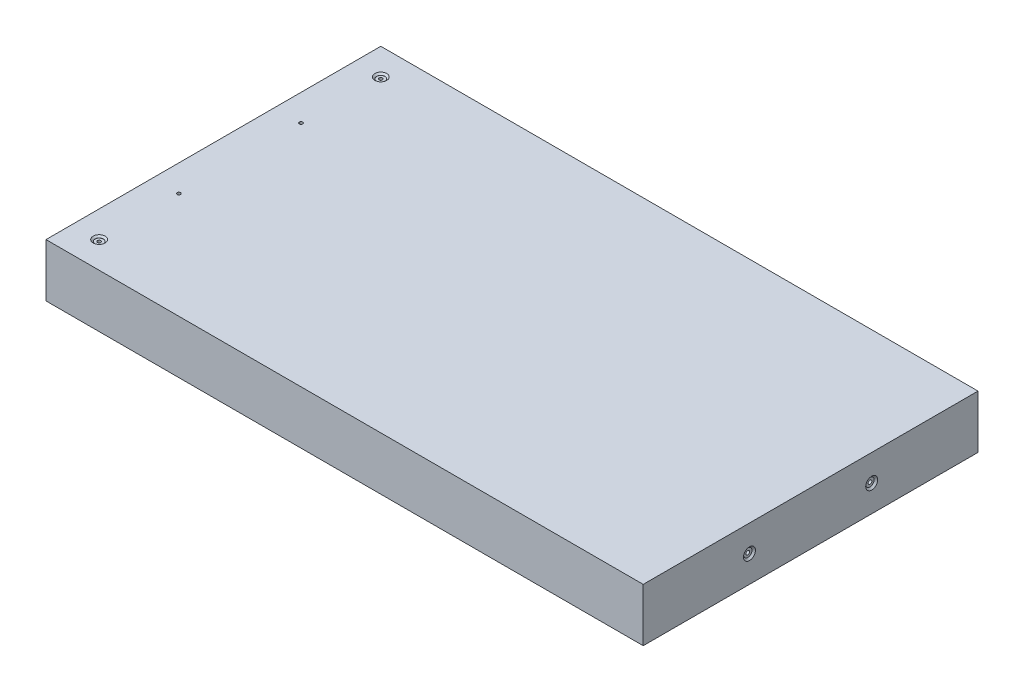
ISO-10303-21;
HEADER;
FILE_DESCRIPTION(('STEP AP214'),'2;1');
FILE_NAME('part.step','',(''),(''),'','','');
FILE_SCHEMA(('AUTOMOTIVE_DESIGN { 1 0 10303 214 1 1 1 1 }'));
ENDSEC;
DATA;
#1=APPLICATION_CONTEXT('core data for automotive mechanical design processes');
#2=APPLICATION_PROTOCOL_DEFINITION('international standard','automotive_design',2000,#1);
#3=PRODUCT_CONTEXT('',#1,'mechanical');
#4=PRODUCT('Part','Part','',(#3));
#5=PRODUCT_RELATED_PRODUCT_CATEGORY('part','',(#4));
#6=PRODUCT_DEFINITION_FORMATION('','',#4);
#7=PRODUCT_DEFINITION_CONTEXT('part definition',#1,'design');
#8=PRODUCT_DEFINITION('design','',#6,#7);
#9=PRODUCT_DEFINITION_SHAPE('','',#8);
#10=(LENGTH_UNIT() NAMED_UNIT(*) SI_UNIT(.MILLI.,.METRE.));
#11=(NAMED_UNIT(*) PLANE_ANGLE_UNIT() SI_UNIT($,.RADIAN.));
#12=(NAMED_UNIT(*) SI_UNIT($,.STERADIAN.) SOLID_ANGLE_UNIT());
#13=UNCERTAINTY_MEASURE_WITH_UNIT(LENGTH_MEASURE(1.E-05),#10,'distance_accuracy_value','');
#14=(GEOMETRIC_REPRESENTATION_CONTEXT(3) GLOBAL_UNCERTAINTY_ASSIGNED_CONTEXT((#13)) GLOBAL_UNIT_ASSIGNED_CONTEXT((#10,
#11,#12)) REPRESENTATION_CONTEXT('',''));
#15=CARTESIAN_POINT('',(0.,0.,0.));
#16=DIRECTION('',(0.,0.,1.));
#17=DIRECTION('',(1.,0.,0.));
#18=AXIS2_PLACEMENT_3D('',#15,#16,#17);
#19=CARTESIAN_POINT('',(142.7,25.4,-80.));
#20=DIRECTION('',(-1.,0.,0.));
#21=DIRECTION('',(0.,0.,1.));
#22=AXIS2_PLACEMENT_3D('',#19,#20,#21);
#23=PLANE('',#22);
#24=CARTESIAN_POINT('',(142.7,12.7,29.2));
#25=DIRECTION('',(1.,0.,0.));
#26=DIRECTION('',(0.,0.,-1.));
#27=AXIS2_PLACEMENT_3D('',#24,#25,#26);
#28=CIRCLE('',#27,2.8575);
#29=CARTESIAN_POINT('',(142.7,12.7,26.3425));
#30=VERTEX_POINT('',#29);
#31=EDGE_CURVE('E164',#30,#30,#28,.T.);
#32=ORIENTED_EDGE('',*,*,#31,.F.);
#33=EDGE_LOOP('',(#32));
#34=FACE_BOUND('',#33,.T.);
#35=CARTESIAN_POINT('',(142.7,12.7,-29.2));
#36=DIRECTION('',(1.,0.,0.));
#37=DIRECTION('',(0.,0.,-1.));
#38=AXIS2_PLACEMENT_3D('',#35,#36,#37);
#39=CIRCLE('',#38,2.8575);
#40=CARTESIAN_POINT('',(142.7,12.7,-32.0575));
#41=VERTEX_POINT('',#40);
#42=EDGE_CURVE('E97',#41,#41,#39,.T.);
#43=ORIENTED_EDGE('',*,*,#42,.F.);
#44=EDGE_LOOP('',(#43));
#45=FACE_BOUND('',#44,.T.);
#46=DIRECTION('',(0.,0.,-1.));
#47=VECTOR('',#46,1.);
#48=CARTESIAN_POINT('',(142.7,0.,-80.));
#49=LINE('',#48,#47);
#50=CARTESIAN_POINT('',(142.7,0.,80.));
#51=VERTEX_POINT('',#50);
#52=CARTESIAN_POINT('',(142.7,0.,-80.));
#53=VERTEX_POINT('',#52);
#54=EDGE_CURVE('E119',#51,#53,#49,.T.);
#55=ORIENTED_EDGE('',*,*,#54,.T.);
#56=DIRECTION('',(0.,-1.,0.));
#57=VECTOR('',#56,1.);
#58=CARTESIAN_POINT('',(142.7,25.4,-80.));
#59=LINE('',#58,#57);
#60=CARTESIAN_POINT('',(142.7,25.4,-80.));
#61=VERTEX_POINT('',#60);
#62=EDGE_CURVE('E11',#61,#53,#59,.T.);
#63=ORIENTED_EDGE('',*,*,#62,.F.);
#64=DIRECTION('',(0.,0.,-1.));
#65=VECTOR('',#64,1.);
#66=CARTESIAN_POINT('',(142.7,25.4,-80.));
#67=LINE('',#66,#65);
#68=CARTESIAN_POINT('',(142.7,25.4,80.));
#69=VERTEX_POINT('',#68);
#70=EDGE_CURVE('E120',#69,#61,#67,.T.);
#71=ORIENTED_EDGE('',*,*,#70,.F.);
#72=DIRECTION('',(0.,-1.,0.));
#73=VECTOR('',#72,1.);
#74=CARTESIAN_POINT('',(142.7,25.4,80.));
#75=LINE('',#74,#73);
#76=EDGE_CURVE('E126',#69,#51,#75,.T.);
#77=ORIENTED_EDGE('',*,*,#76,.T.);
#78=EDGE_LOOP('',(#55,#63,#71,#77));
#79=FACE_BOUND('',#78,.T.);
#80=ADVANCED_FACE('F33',(#34,#45,#79),#23,.F.);
#81=CARTESIAN_POINT('',(-142.7,25.4,-80.));
#82=DIRECTION('',(0.,0.,1.));
#83=DIRECTION('',(1.,0.,0.));
#84=AXIS2_PLACEMENT_3D('',#81,#82,#83);
#85=PLANE('',#84);
#86=DIRECTION('',(-1.,0.,0.));
#87=VECTOR('',#86,1.);
#88=CARTESIAN_POINT('',(-142.7,0.,-80.));
#89=LINE('',#88,#87);
#90=CARTESIAN_POINT('',(-142.7,0.,-80.));
#91=VERTEX_POINT('',#90);
#92=EDGE_CURVE('E129',#53,#91,#89,.T.);
#93=ORIENTED_EDGE('',*,*,#92,.T.);
#94=DIRECTION('',(0.,-1.,0.));
#95=VECTOR('',#94,1.);
#96=CARTESIAN_POINT('',(-142.7,25.4,-80.));
#97=LINE('',#96,#95);
#98=CARTESIAN_POINT('',(-142.7,25.4,-80.));
#99=VERTEX_POINT('',#98);
#100=EDGE_CURVE('E41',#99,#91,#97,.T.);
#101=ORIENTED_EDGE('',*,*,#100,.F.);
#102=DIRECTION('',(-1.,0.,0.));
#103=VECTOR('',#102,1.);
#104=CARTESIAN_POINT('',(-142.7,25.4,-80.));
#105=LINE('',#104,#103);
#106=EDGE_CURVE('E80',#61,#99,#105,.T.);
#107=ORIENTED_EDGE('',*,*,#106,.F.);
#108=ORIENTED_EDGE('',*,*,#62,.T.);
#109=EDGE_LOOP('',(#93,#101,#107,#108));
#110=FACE_BOUND('',#109,.T.);
#111=ADVANCED_FACE('F153',(#110),#85,.F.);
#112=CARTESIAN_POINT('',(-142.7,25.4,-80.));
#113=DIRECTION('',(1.,0.,0.));
#114=DIRECTION('',(0.,0.,-1.));
#115=AXIS2_PLACEMENT_3D('',#112,#113,#114);
#116=PLANE('',#115);
#117=DIRECTION('',(0.,0.,1.));
#118=VECTOR('',#117,1.);
#119=CARTESIAN_POINT('',(-142.7,0.,-80.));
#120=LINE('',#119,#118);
#121=CARTESIAN_POINT('',(-142.7,0.,80.));
#122=VERTEX_POINT('',#121);
#123=EDGE_CURVE('E67',#91,#122,#120,.T.);
#124=ORIENTED_EDGE('',*,*,#123,.T.);
#125=DIRECTION('',(0.,-1.,0.));
#126=VECTOR('',#125,1.);
#127=CARTESIAN_POINT('',(-142.7,25.4,80.));
#128=LINE('',#127,#126);
#129=CARTESIAN_POINT('',(-142.7,25.4,80.));
#130=VERTEX_POINT('',#129);
#131=EDGE_CURVE('E134',#130,#122,#128,.T.);
#132=ORIENTED_EDGE('',*,*,#131,.F.);
#133=DIRECTION('',(0.,0.,1.));
#134=VECTOR('',#133,1.);
#135=CARTESIAN_POINT('',(-142.7,25.4,-80.));
#136=LINE('',#135,#134);
#137=EDGE_CURVE('E123',#99,#130,#136,.T.);
#138=ORIENTED_EDGE('',*,*,#137,.F.);
#139=ORIENTED_EDGE('',*,*,#100,.T.);
#140=EDGE_LOOP('',(#124,#132,#138,#139));
#141=FACE_BOUND('',#140,.T.);
#142=ADVANCED_FACE('F136',(#141),#116,.F.);
#143=CARTESIAN_POINT('',(-142.7,25.4,80.));
#144=DIRECTION('',(0.,0.,-1.));
#145=DIRECTION('',(-1.,0.,0.));
#146=AXIS2_PLACEMENT_3D('',#143,#144,#145);
#147=PLANE('',#146);
#148=DIRECTION('',(1.,0.,0.));
#149=VECTOR('',#148,1.);
#150=CARTESIAN_POINT('',(-142.7,0.,80.));
#151=LINE('',#150,#149);
#152=EDGE_CURVE('E73',#122,#51,#151,.T.);
#153=ORIENTED_EDGE('',*,*,#152,.T.);
#154=ORIENTED_EDGE('',*,*,#76,.F.);
#155=DIRECTION('',(1.,0.,0.));
#156=VECTOR('',#155,1.);
#157=CARTESIAN_POINT('',(-142.7,25.4,80.));
#158=LINE('',#157,#156);
#159=EDGE_CURVE('E49',#130,#69,#158,.T.);
#160=ORIENTED_EDGE('',*,*,#159,.F.);
#161=ORIENTED_EDGE('',*,*,#131,.T.);
#162=EDGE_LOOP('',(#153,#154,#160,#161));
#163=FACE_BOUND('',#162,.T.);
#164=ADVANCED_FACE('F143',(#163),#147,.F.);
#165=CARTESIAN_POINT('',(0.,25.4,0.));
#166=DIRECTION('',(0.,1.,0.));
#167=DIRECTION('',(0.,0.,1.));
#168=AXIS2_PLACEMENT_3D('',#165,#166,#167);
#169=PLANE('',#168);
#170=CARTESIAN_POINT('',(-130.,25.4,-29.2));
#171=DIRECTION('',(0.,-1.,0.));
#172=DIRECTION('',(0.,0.,-1.));
#173=AXIS2_PLACEMENT_3D('',#170,#171,#172);
#174=CIRCLE('',#173,0.806449999999986);
#175=CARTESIAN_POINT('',(-130.,25.4,-30.00645));
#176=VERTEX_POINT('',#175);
#177=EDGE_CURVE('E447',#176,#176,#174,.T.);
#178=ORIENTED_EDGE('',*,*,#177,.T.);
#179=EDGE_LOOP('',(#178));
#180=FACE_BOUND('',#179,.T.);
#181=CARTESIAN_POINT('',(-130.,25.4,29.2));
#182=DIRECTION('',(0.,-1.,0.));
#183=DIRECTION('',(0.,0.,-1.));
#184=AXIS2_PLACEMENT_3D('',#181,#182,#183);
#185=CIRCLE('',#184,0.806449999999986);
#186=CARTESIAN_POINT('',(-130.,25.4,28.39355));
#187=VERTEX_POINT('',#186);
#188=EDGE_CURVE('E460',#187,#187,#185,.T.);
#189=ORIENTED_EDGE('',*,*,#188,.T.);
#190=EDGE_LOOP('',(#189));
#191=FACE_BOUND('',#190,.T.);
#192=CARTESIAN_POINT('',(-130.,25.4,67.3));
#193=DIRECTION('',(0.,1.,0.));
#194=DIRECTION('',(0.,0.,1.));
#195=AXIS2_PLACEMENT_3D('',#192,#193,#194);
#196=CIRCLE('',#195,2.85750000000001);
#197=CARTESIAN_POINT('',(-130.,25.4,70.1575));
#198=VERTEX_POINT('',#197);
#199=EDGE_CURVE('E463',#198,#198,#196,.T.);
#200=ORIENTED_EDGE('',*,*,#199,.F.);
#201=EDGE_LOOP('',(#200));
#202=FACE_BOUND('',#201,.T.);
#203=CARTESIAN_POINT('',(-130.,25.4,-67.3));
#204=DIRECTION('',(0.,1.,0.));
#205=DIRECTION('',(0.,0.,1.));
#206=AXIS2_PLACEMENT_3D('',#203,#204,#205);
#207=CIRCLE('',#206,2.85750000000001);
#208=CARTESIAN_POINT('',(-130.,25.4,-64.4425));
#209=VERTEX_POINT('',#208);
#210=EDGE_CURVE('E476',#209,#209,#207,.T.);
#211=ORIENTED_EDGE('',*,*,#210,.F.);
#212=EDGE_LOOP('',(#211));
#213=FACE_BOUND('',#212,.T.);
#214=ORIENTED_EDGE('',*,*,#70,.T.);
#215=ORIENTED_EDGE('',*,*,#106,.T.);
#216=ORIENTED_EDGE('',*,*,#137,.T.);
#217=ORIENTED_EDGE('',*,*,#159,.T.);
#218=EDGE_LOOP('',(#214,#215,#216,#217));
#219=FACE_BOUND('',#218,.T.);
#220=ADVANCED_FACE('F145',(#180,#191,#202,#213,#219),#169,.T.);
#221=CARTESIAN_POINT('',(0.,0.,0.));
#222=DIRECTION('',(0.,1.,0.));
#223=DIRECTION('',(0.,0.,1.));
#224=AXIS2_PLACEMENT_3D('',#221,#222,#223);
#225=PLANE('',#224);
#226=CARTESIAN_POINT('',(-130.,0.,-29.2));
#227=DIRECTION('',(0.,-1.,0.));
#228=DIRECTION('',(0.,0.,-1.));
#229=AXIS2_PLACEMENT_3D('',#226,#227,#228);
#230=CIRCLE('',#229,2.85750000000001);
#231=CARTESIAN_POINT('',(-130.,0.,-32.0575));
#232=VERTEX_POINT('',#231);
#233=EDGE_CURVE('E197',#232,#232,#230,.T.);
#234=ORIENTED_EDGE('',*,*,#233,.F.);
#235=EDGE_LOOP('',(#234));
#236=FACE_BOUND('',#235,.T.);
#237=CARTESIAN_POINT('',(-130.,0.,29.2));
#238=DIRECTION('',(0.,-1.,0.));
#239=DIRECTION('',(0.,0.,-1.));
#240=AXIS2_PLACEMENT_3D('',#237,#238,#239);
#241=CIRCLE('',#240,2.85750000000001);
#242=CARTESIAN_POINT('',(-130.,0.,26.3425));
#243=VERTEX_POINT('',#242);
#244=EDGE_CURVE('E201',#243,#243,#241,.T.);
#245=ORIENTED_EDGE('',*,*,#244,.F.);
#246=EDGE_LOOP('',(#245));
#247=FACE_BOUND('',#246,.T.);
#248=CARTESIAN_POINT('',(-130.,0.,67.3));
#249=DIRECTION('',(0.,1.,0.));
#250=DIRECTION('',(0.,0.,1.));
#251=AXIS2_PLACEMENT_3D('',#248,#249,#250);
#252=CIRCLE('',#251,0.806449999999986);
#253=CARTESIAN_POINT('',(-130.,0.,68.10645));
#254=VERTEX_POINT('',#253);
#255=EDGE_CURVE('E205',#254,#254,#252,.T.);
#256=ORIENTED_EDGE('',*,*,#255,.T.);
#257=EDGE_LOOP('',(#256));
#258=FACE_BOUND('',#257,.T.);
#259=CARTESIAN_POINT('',(-130.,0.,-67.3));
#260=DIRECTION('',(0.,1.,0.));
#261=DIRECTION('',(0.,0.,1.));
#262=AXIS2_PLACEMENT_3D('',#259,#260,#261);
#263=CIRCLE('',#262,0.806449999999986);
#264=CARTESIAN_POINT('',(-130.,0.,-66.49355));
#265=VERTEX_POINT('',#264);
#266=EDGE_CURVE('E208',#265,#265,#263,.T.);
#267=ORIENTED_EDGE('',*,*,#266,.T.);
#268=EDGE_LOOP('',(#267));
#269=FACE_BOUND('',#268,.T.);
#270=ORIENTED_EDGE('',*,*,#54,.F.);
#271=ORIENTED_EDGE('',*,*,#152,.F.);
#272=ORIENTED_EDGE('',*,*,#123,.F.);
#273=ORIENTED_EDGE('',*,*,#92,.F.);
#274=EDGE_LOOP('',(#270,#271,#272,#273));
#275=FACE_BOUND('',#274,.T.);
#276=ADVANCED_FACE('F139',(#236,#247,#258,#269,#275),#225,.F.);
#277=CARTESIAN_POINT('',(112.7,12.7,-29.2));
#278=DIRECTION('',(1.,0.,0.));
#279=DIRECTION('',(0.,0.,-1.));
#280=AXIS2_PLACEMENT_3D('',#277,#278,#279);
#281=CONICAL_SURFACE('',#280,0.889000000000001,1.02974425867665);
#282=CARTESIAN_POINT('',(112.165834909685,12.7,-29.2));
#283=VERTEX_POINT('',#282);
#284=VERTEX_LOOP('',#283);
#285=FACE_BOUND('',#284,.T.);
#286=CARTESIAN_POINT('',(112.7,12.7,-29.2));
#287=DIRECTION('',(1.,0.,0.));
#288=DIRECTION('',(0.,0.,-1.));
#289=AXIS2_PLACEMENT_3D('',#286,#287,#288);
#290=CIRCLE('',#289,0.889000000000001);
#291=CARTESIAN_POINT('',(112.7,12.7,-30.089));
#292=VERTEX_POINT('',#291);
#293=EDGE_CURVE('E116',#292,#292,#290,.T.);
#294=ORIENTED_EDGE('',*,*,#293,.T.);
#295=EDGE_LOOP('',(#294));
#296=FACE_BOUND('',#295,.T.);
#297=ADVANCED_FACE('F186',(#285,#296),#281,.F.);
#298=CARTESIAN_POINT('',(142.7,12.7,-29.2));
#299=DIRECTION('',(1.,0.,0.));
#300=DIRECTION('',(0.,0.,-1.));
#301=AXIS2_PLACEMENT_3D('',#298,#299,#300);
#302=CYLINDRICAL_SURFACE('',#301,0.889000000000003);
#303=ORIENTED_EDGE('',*,*,#293,.F.);
#304=EDGE_LOOP('',(#303));
#305=FACE_BOUND('',#304,.T.);
#306=CARTESIAN_POINT('',(141.8872,12.7,-29.2));
#307=DIRECTION('',(1.,0.,0.));
#308=DIRECTION('',(0.,0.,-1.));
#309=AXIS2_PLACEMENT_3D('',#306,#307,#308);
#310=CIRCLE('',#309,0.889000000000004);
#311=CARTESIAN_POINT('',(141.8872,12.7,-30.089));
#312=VERTEX_POINT('',#311);
#313=EDGE_CURVE('E113',#312,#312,#310,.T.);
#314=ORIENTED_EDGE('',*,*,#313,.T.);
#315=EDGE_LOOP('',(#314));
#316=FACE_BOUND('',#315,.T.);
#317=ADVANCED_FACE('F182',(#305,#316),#302,.F.);
#318=CARTESIAN_POINT('',(141.8872,13.589,-29.2));
#319=DIRECTION('',(-1.,0.,0.));
#320=DIRECTION('',(0.,0.,1.));
#321=AXIS2_PLACEMENT_3D('',#318,#319,#320);
#322=PLANE('',#321);
#323=ORIENTED_EDGE('',*,*,#313,.F.);
#324=EDGE_LOOP('',(#323));
#325=FACE_BOUND('',#324,.T.);
#326=CARTESIAN_POINT('',(141.8872,12.7,-29.2));
#327=DIRECTION('',(1.,0.,0.));
#328=DIRECTION('',(0.,0.,-1.));
#329=AXIS2_PLACEMENT_3D('',#326,#327,#328);
#330=CIRCLE('',#329,1.98501);
#331=CARTESIAN_POINT('',(141.8872,12.7,-31.18501));
#332=VERTEX_POINT('',#331);
#333=EDGE_CURVE('E110',#332,#332,#330,.T.);
#334=ORIENTED_EDGE('',*,*,#333,.T.);
#335=EDGE_LOOP('',(#334));
#336=FACE_BOUND('',#335,.T.);
#337=ADVANCED_FACE('F174',(#325,#336),#322,.F.);
#338=CARTESIAN_POINT('',(142.7,12.7,-29.2));
#339=DIRECTION('',(1.,0.,0.));
#340=DIRECTION('',(0.,0.,-1.));
#341=AXIS2_PLACEMENT_3D('',#338,#339,#340);
#342=CYLINDRICAL_SURFACE('',#341,1.98501);
#343=ORIENTED_EDGE('',*,*,#333,.F.);
#344=EDGE_LOOP('',(#343));
#345=FACE_BOUND('',#344,.T.);
#346=CARTESIAN_POINT('',(141.82751,12.7,-29.2));
#347=DIRECTION('',(1.,0.,0.));
#348=DIRECTION('',(0.,0.,-1.));
#349=AXIS2_PLACEMENT_3D('',#346,#347,#348);
#350=CIRCLE('',#349,1.98501);
#351=CARTESIAN_POINT('',(141.82751,12.7,-31.18501));
#352=VERTEX_POINT('',#351);
#353=EDGE_CURVE('E101',#352,#352,#350,.T.);
#354=ORIENTED_EDGE('',*,*,#353,.T.);
#355=EDGE_LOOP('',(#354));
#356=FACE_BOUND('',#355,.T.);
#357=ADVANCED_FACE('F168',(#345,#356),#342,.T.);
#358=CARTESIAN_POINT('',(142.7,12.7,-29.2));
#359=DIRECTION('',(1.,0.,0.));
#360=DIRECTION('',(0.,0.,-1.));
#361=AXIS2_PLACEMENT_3D('',#358,#359,#360);
#362=CONICAL_SURFACE('',#361,2.8575,0.785398163397446);
#363=ORIENTED_EDGE('',*,*,#353,.F.);
#364=EDGE_LOOP('',(#363));
#365=FACE_BOUND('',#364,.T.);
#366=ORIENTED_EDGE('',*,*,#42,.T.);
#367=EDGE_LOOP('',(#366));
#368=FACE_BOUND('',#367,.T.);
#369=ADVANCED_FACE('F91',(#365,#368),#362,.F.);
#370=CARTESIAN_POINT('',(112.7,12.7,29.2));
#371=DIRECTION('',(1.,0.,0.));
#372=DIRECTION('',(0.,0.,-1.));
#373=AXIS2_PLACEMENT_3D('',#370,#371,#372);
#374=CONICAL_SURFACE('',#373,0.889000000000001,1.02974425867665);
#375=CARTESIAN_POINT('',(112.165834909685,12.7,29.2));
#376=VERTEX_POINT('',#375);
#377=VERTEX_LOOP('',#376);
#378=FACE_BOUND('',#377,.T.);
#379=CARTESIAN_POINT('',(112.7,12.7,29.2));
#380=DIRECTION('',(1.,0.,0.));
#381=DIRECTION('',(0.,0.,-1.));
#382=AXIS2_PLACEMENT_3D('',#379,#380,#381);
#383=CIRCLE('',#382,0.889000000000001);
#384=CARTESIAN_POINT('',(112.7,12.7,28.311));
#385=VERTEX_POINT('',#384);
#386=EDGE_CURVE('E95',#385,#385,#383,.T.);
#387=ORIENTED_EDGE('',*,*,#386,.T.);
#388=EDGE_LOOP('',(#387));
#389=FACE_BOUND('',#388,.T.);
#390=ADVANCED_FACE('F87',(#378,#389),#374,.F.);
#391=CARTESIAN_POINT('',(142.7,12.7,29.2));
#392=DIRECTION('',(1.,0.,0.));
#393=DIRECTION('',(0.,0.,-1.));
#394=AXIS2_PLACEMENT_3D('',#391,#392,#393);
#395=CYLINDRICAL_SURFACE('',#394,0.889000000000003);
#396=ORIENTED_EDGE('',*,*,#386,.F.);
#397=EDGE_LOOP('',(#396));
#398=FACE_BOUND('',#397,.T.);
#399=CARTESIAN_POINT('',(141.8872,12.7,29.2));
#400=DIRECTION('',(1.,0.,0.));
#401=DIRECTION('',(0.,0.,-1.));
#402=AXIS2_PLACEMENT_3D('',#399,#400,#401);
#403=CIRCLE('',#402,0.889000000000004);
#404=CARTESIAN_POINT('',(141.8872,12.7,28.311));
#405=VERTEX_POINT('',#404);
#406=EDGE_CURVE('E98',#405,#405,#403,.T.);
#407=ORIENTED_EDGE('',*,*,#406,.T.);
#408=EDGE_LOOP('',(#407));
#409=FACE_BOUND('',#408,.T.);
#410=ADVANCED_FACE('F90',(#398,#409),#395,.F.);
#411=CARTESIAN_POINT('',(141.8872,13.589,29.2));
#412=DIRECTION('',(-1.,0.,0.));
#413=DIRECTION('',(0.,0.,1.));
#414=AXIS2_PLACEMENT_3D('',#411,#412,#413);
#415=PLANE('',#414);
#416=ORIENTED_EDGE('',*,*,#406,.F.);
#417=EDGE_LOOP('',(#416));
#418=FACE_BOUND('',#417,.T.);
#419=CARTESIAN_POINT('',(141.8872,12.7,29.2));
#420=DIRECTION('',(1.,0.,0.));
#421=DIRECTION('',(0.,0.,-1.));
#422=AXIS2_PLACEMENT_3D('',#419,#420,#421);
#423=CIRCLE('',#422,1.98501);
#424=CARTESIAN_POINT('',(141.8872,12.7,27.21499));
#425=VERTEX_POINT('',#424);
#426=EDGE_CURVE('E104',#425,#425,#423,.T.);
#427=ORIENTED_EDGE('',*,*,#426,.T.);
#428=EDGE_LOOP('',(#427));
#429=FACE_BOUND('',#428,.T.);
#430=ADVANCED_FACE('F223',(#418,#429),#415,.F.);
#431=CARTESIAN_POINT('',(142.7,12.7,29.2));
#432=DIRECTION('',(1.,0.,0.));
#433=DIRECTION('',(0.,0.,-1.));
#434=AXIS2_PLACEMENT_3D('',#431,#432,#433);
#435=CYLINDRICAL_SURFACE('',#434,1.98501);
#436=ORIENTED_EDGE('',*,*,#426,.F.);
#437=EDGE_LOOP('',(#436));
#438=FACE_BOUND('',#437,.T.);
#439=CARTESIAN_POINT('',(141.82751,12.7,29.2));
#440=DIRECTION('',(1.,0.,0.));
#441=DIRECTION('',(0.,0.,-1.));
#442=AXIS2_PLACEMENT_3D('',#439,#440,#441);
#443=CIRCLE('',#442,1.98501);
#444=CARTESIAN_POINT('',(141.82751,12.7,27.21499));
#445=VERTEX_POINT('',#444);
#446=EDGE_CURVE('E212',#445,#445,#443,.T.);
#447=ORIENTED_EDGE('',*,*,#446,.T.);
#448=EDGE_LOOP('',(#447));
#449=FACE_BOUND('',#448,.T.);
#450=ADVANCED_FACE('F225',(#438,#449),#435,.T.);
#451=CARTESIAN_POINT('',(142.7,12.7,29.2));
#452=DIRECTION('',(1.,0.,0.));
#453=DIRECTION('',(0.,0.,-1.));
#454=AXIS2_PLACEMENT_3D('',#451,#452,#453);
#455=CONICAL_SURFACE('',#454,2.8575,0.785398163397446);
#456=ORIENTED_EDGE('',*,*,#446,.F.);
#457=EDGE_LOOP('',(#456));
#458=FACE_BOUND('',#457,.T.);
#459=ORIENTED_EDGE('',*,*,#31,.T.);
#460=EDGE_LOOP('',(#459));
#461=FACE_BOUND('',#460,.T.);
#462=ADVANCED_FACE('F228',(#458,#461),#455,.F.);
#463=CARTESIAN_POINT('',(-130.,25.4,-67.3));
#464=DIRECTION('',(0.,1.,0.));
#465=DIRECTION('',(0.,0.,1.));
#466=AXIS2_PLACEMENT_3D('',#463,#464,#465);
#467=CYLINDRICAL_SURFACE('',#466,0.80645);
#468=ORIENTED_EDGE('',*,*,#266,.F.);
#469=EDGE_LOOP('',(#468));
#470=FACE_BOUND('',#469,.T.);
#471=CARTESIAN_POINT('',(-130.,24.5872,-67.3));
#472=DIRECTION('',(0.,1.,0.));
#473=DIRECTION('',(0.,0.,1.));
#474=AXIS2_PLACEMENT_3D('',#471,#472,#473);
#475=CIRCLE('',#474,0.806450000000014);
#476=CARTESIAN_POINT('',(-130.,24.5872,-66.49355));
#477=VERTEX_POINT('',#476);
#478=EDGE_CURVE('E210',#477,#477,#475,.T.);
#479=ORIENTED_EDGE('',*,*,#478,.T.);
#480=EDGE_LOOP('',(#479));
#481=FACE_BOUND('',#480,.T.);
#482=ADVANCED_FACE('F234',(#470,#481),#467,.F.);
#483=CARTESIAN_POINT('',(-128.01499,24.5872,-67.3));
#484=DIRECTION('',(0.,-1.,0.));
#485=DIRECTION('',(0.,0.,-1.));
#486=AXIS2_PLACEMENT_3D('',#483,#484,#485);
#487=PLANE('',#486);
#488=ORIENTED_EDGE('',*,*,#478,.F.);
#489=EDGE_LOOP('',(#488));
#490=FACE_BOUND('',#489,.T.);
#491=CARTESIAN_POINT('',(-130.,24.5872,-67.3));
#492=DIRECTION('',(0.,1.,0.));
#493=DIRECTION('',(0.,0.,1.));
#494=AXIS2_PLACEMENT_3D('',#491,#492,#493);
#495=CIRCLE('',#494,1.98501000000001);
#496=CARTESIAN_POINT('',(-130.,24.5872,-65.31499));
#497=VERTEX_POINT('',#496);
#498=EDGE_CURVE('E215',#497,#497,#495,.T.);
#499=ORIENTED_EDGE('',*,*,#498,.T.);
#500=EDGE_LOOP('',(#499));
#501=FACE_BOUND('',#500,.T.);
#502=ADVANCED_FACE('F239',(#490,#501),#487,.F.);
#503=CARTESIAN_POINT('',(-130.,25.4,-67.3));
#504=DIRECTION('',(0.,1.,0.));
#505=DIRECTION('',(0.,0.,1.));
#506=AXIS2_PLACEMENT_3D('',#503,#504,#505);
#507=CYLINDRICAL_SURFACE('',#506,1.98501000000001);
#508=ORIENTED_EDGE('',*,*,#498,.F.);
#509=EDGE_LOOP('',(#508));
#510=FACE_BOUND('',#509,.T.);
#511=CARTESIAN_POINT('',(-130.,24.6678939627941,-67.3));
#512=DIRECTION('',(0.,1.,0.));
#513=DIRECTION('',(0.,0.,1.));
#514=AXIS2_PLACEMENT_3D('',#511,#512,#513);
#515=CIRCLE('',#514,1.98501000000001);
#516=CARTESIAN_POINT('',(-130.,24.6678939627941,-65.31499));
#517=VERTEX_POINT('',#516);
#518=EDGE_CURVE('E479',#517,#517,#515,.T.);
#519=ORIENTED_EDGE('',*,*,#518,.T.);
#520=EDGE_LOOP('',(#519));
#521=FACE_BOUND('',#520,.T.);
#522=ADVANCED_FACE('F279',(#510,#521),#507,.F.);
#523=CARTESIAN_POINT('',(-130.,25.4,-67.3));
#524=DIRECTION('',(0.,1.,0.));
#525=DIRECTION('',(0.,0.,1.));
#526=AXIS2_PLACEMENT_3D('',#523,#524,#525);
#527=CONICAL_SURFACE('',#526,2.85750000000001,0.872664625997166);
#528=ORIENTED_EDGE('',*,*,#518,.F.);
#529=EDGE_LOOP('',(#528));
#530=FACE_BOUND('',#529,.T.);
#531=ORIENTED_EDGE('',*,*,#210,.T.);
#532=EDGE_LOOP('',(#531));
#533=FACE_BOUND('',#532,.T.);
#534=ADVANCED_FACE('F288',(#530,#533),#527,.F.);
#535=CARTESIAN_POINT('',(-130.,25.4,67.3));
#536=DIRECTION('',(0.,1.,0.));
#537=DIRECTION('',(0.,0.,1.));
#538=AXIS2_PLACEMENT_3D('',#535,#536,#537);
#539=CYLINDRICAL_SURFACE('',#538,0.80645);
#540=ORIENTED_EDGE('',*,*,#255,.F.);
#541=EDGE_LOOP('',(#540));
#542=FACE_BOUND('',#541,.T.);
#543=CARTESIAN_POINT('',(-130.,24.5872,67.3));
#544=DIRECTION('',(0.,1.,0.));
#545=DIRECTION('',(0.,0.,1.));
#546=AXIS2_PLACEMENT_3D('',#543,#544,#545);
#547=CIRCLE('',#546,0.806450000000014);
#548=CARTESIAN_POINT('',(-130.,24.5872,68.10645));
#549=VERTEX_POINT('',#548);
#550=EDGE_CURVE('E472',#549,#549,#547,.T.);
#551=ORIENTED_EDGE('',*,*,#550,.T.);
#552=EDGE_LOOP('',(#551));
#553=FACE_BOUND('',#552,.T.);
#554=ADVANCED_FACE('F298',(#542,#553),#539,.F.);
#555=CARTESIAN_POINT('',(-128.01499,24.5872,67.3));
#556=DIRECTION('',(0.,-1.,0.));
#557=DIRECTION('',(0.,0.,-1.));
#558=AXIS2_PLACEMENT_3D('',#555,#556,#557);
#559=PLANE('',#558);
#560=ORIENTED_EDGE('',*,*,#550,.F.);
#561=EDGE_LOOP('',(#560));
#562=FACE_BOUND('',#561,.T.);
#563=CARTESIAN_POINT('',(-130.,24.5872,67.3));
#564=DIRECTION('',(0.,1.,0.));
#565=DIRECTION('',(0.,0.,1.));
#566=AXIS2_PLACEMENT_3D('',#563,#564,#565);
#567=CIRCLE('',#566,1.98501000000001);
#568=CARTESIAN_POINT('',(-130.,24.5872,69.28501));
#569=VERTEX_POINT('',#568);
#570=EDGE_CURVE('E469',#569,#569,#567,.T.);
#571=ORIENTED_EDGE('',*,*,#570,.T.);
#572=EDGE_LOOP('',(#571));
#573=FACE_BOUND('',#572,.T.);
#574=ADVANCED_FACE('F308',(#562,#573),#559,.F.);
#575=CARTESIAN_POINT('',(-130.,25.4,67.3));
#576=DIRECTION('',(0.,1.,0.));
#577=DIRECTION('',(0.,0.,1.));
#578=AXIS2_PLACEMENT_3D('',#575,#576,#577);
#579=CYLINDRICAL_SURFACE('',#578,1.98501000000001);
#580=ORIENTED_EDGE('',*,*,#570,.F.);
#581=EDGE_LOOP('',(#580));
#582=FACE_BOUND('',#581,.T.);
#583=CARTESIAN_POINT('',(-130.,24.6678939627941,67.3));
#584=DIRECTION('',(0.,1.,0.));
#585=DIRECTION('',(0.,0.,1.));
#586=AXIS2_PLACEMENT_3D('',#583,#584,#585);
#587=CIRCLE('',#586,1.98501000000001);
#588=CARTESIAN_POINT('',(-130.,24.6678939627941,69.28501));
#589=VERTEX_POINT('',#588);
#590=EDGE_CURVE('E466',#589,#589,#587,.T.);
#591=ORIENTED_EDGE('',*,*,#590,.T.);
#592=EDGE_LOOP('',(#591));
#593=FACE_BOUND('',#592,.T.);
#594=ADVANCED_FACE('F318',(#582,#593),#579,.F.);
#595=CARTESIAN_POINT('',(-130.,25.4,67.3));
#596=DIRECTION('',(0.,1.,0.));
#597=DIRECTION('',(0.,0.,1.));
#598=AXIS2_PLACEMENT_3D('',#595,#596,#597);
#599=CONICAL_SURFACE('',#598,2.85750000000001,0.872664625997166);
#600=ORIENTED_EDGE('',*,*,#590,.F.);
#601=EDGE_LOOP('',(#600));
#602=FACE_BOUND('',#601,.T.);
#603=ORIENTED_EDGE('',*,*,#199,.T.);
#604=EDGE_LOOP('',(#603));
#605=FACE_BOUND('',#604,.T.);
#606=ADVANCED_FACE('F328',(#602,#605),#599,.F.);
#607=CARTESIAN_POINT('',(-130.,0.,29.2));
#608=DIRECTION('',(0.,-1.,0.));
#609=DIRECTION('',(0.,0.,-1.));
#610=AXIS2_PLACEMENT_3D('',#607,#608,#609);
#611=CYLINDRICAL_SURFACE('',#610,0.80645);
#612=ORIENTED_EDGE('',*,*,#188,.F.);
#613=EDGE_LOOP('',(#612));
#614=FACE_BOUND('',#613,.T.);
#615=CARTESIAN_POINT('',(-130.,0.812799999999992,29.2));
#616=DIRECTION('',(0.,-1.,0.));
#617=DIRECTION('',(0.,0.,-1.));
#618=AXIS2_PLACEMENT_3D('',#615,#616,#617);
#619=CIRCLE('',#618,0.806450000000014);
#620=CARTESIAN_POINT('',(-130.,0.812799999999992,28.39355));
#621=VERTEX_POINT('',#620);
#622=EDGE_CURVE('E457',#621,#621,#619,.T.);
#623=ORIENTED_EDGE('',*,*,#622,.T.);
#624=EDGE_LOOP('',(#623));
#625=FACE_BOUND('',#624,.T.);
#626=ADVANCED_FACE('F338',(#614,#625),#611,.F.);
#627=CARTESIAN_POINT('',(-128.01499,0.812799999999992,29.2));
#628=DIRECTION('',(0.,1.,0.));
#629=DIRECTION('',(0.,0.,1.));
#630=AXIS2_PLACEMENT_3D('',#627,#628,#629);
#631=PLANE('',#630);
#632=ORIENTED_EDGE('',*,*,#622,.F.);
#633=EDGE_LOOP('',(#632));
#634=FACE_BOUND('',#633,.T.);
#635=CARTESIAN_POINT('',(-130.,0.812799999999992,29.2));
#636=DIRECTION('',(0.,-1.,0.));
#637=DIRECTION('',(0.,0.,-1.));
#638=AXIS2_PLACEMENT_3D('',#635,#636,#637);
#639=CIRCLE('',#638,1.98501000000001);
#640=CARTESIAN_POINT('',(-130.,0.812799999999992,27.21499));
#641=VERTEX_POINT('',#640);
#642=EDGE_CURVE('E454',#641,#641,#639,.T.);
#643=ORIENTED_EDGE('',*,*,#642,.T.);
#644=EDGE_LOOP('',(#643));
#645=FACE_BOUND('',#644,.T.);
#646=ADVANCED_FACE('F360',(#634,#645),#631,.F.);
#647=CARTESIAN_POINT('',(-130.,0.,29.2));
#648=DIRECTION('',(0.,-1.,0.));
#649=DIRECTION('',(0.,0.,-1.));
#650=AXIS2_PLACEMENT_3D('',#647,#648,#649);
#651=CYLINDRICAL_SURFACE('',#650,1.98501000000001);
#652=ORIENTED_EDGE('',*,*,#642,.F.);
#653=EDGE_LOOP('',(#652));
#654=FACE_BOUND('',#653,.T.);
#655=CARTESIAN_POINT('',(-130.,0.732106037205861,29.2));
#656=DIRECTION('',(0.,-1.,0.));
#657=DIRECTION('',(0.,0.,-1.));
#658=AXIS2_PLACEMENT_3D('',#655,#656,#657);
#659=CIRCLE('',#658,1.98501000000001);
#660=CARTESIAN_POINT('',(-130.,0.732106037205861,27.21499));
#661=VERTEX_POINT('',#660);
#662=EDGE_CURVE('E451',#661,#661,#659,.T.);
#663=ORIENTED_EDGE('',*,*,#662,.T.);
#664=EDGE_LOOP('',(#663));
#665=FACE_BOUND('',#664,.T.);
#666=ADVANCED_FACE('F370',(#654,#665),#651,.F.);
#667=CARTESIAN_POINT('',(-130.,0.,29.2));
#668=DIRECTION('',(0.,-1.,0.));
#669=DIRECTION('',(0.,0.,-1.));
#670=AXIS2_PLACEMENT_3D('',#667,#668,#669);
#671=CONICAL_SURFACE('',#670,2.85750000000001,0.872664625997168);
#672=ORIENTED_EDGE('',*,*,#662,.F.);
#673=EDGE_LOOP('',(#672));
#674=FACE_BOUND('',#673,.T.);
#675=ORIENTED_EDGE('',*,*,#244,.T.);
#676=EDGE_LOOP('',(#675));
#677=FACE_BOUND('',#676,.T.);
#678=ADVANCED_FACE('F380',(#674,#677),#671,.F.);
#679=CARTESIAN_POINT('',(-130.,0.,-29.2));
#680=DIRECTION('',(0.,-1.,0.));
#681=DIRECTION('',(0.,0.,-1.));
#682=AXIS2_PLACEMENT_3D('',#679,#680,#681);
#683=CYLINDRICAL_SURFACE('',#682,0.80645);
#684=ORIENTED_EDGE('',*,*,#177,.F.);
#685=EDGE_LOOP('',(#684));
#686=FACE_BOUND('',#685,.T.);
#687=CARTESIAN_POINT('',(-130.,0.812799999999992,-29.2));
#688=DIRECTION('',(0.,-1.,0.));
#689=DIRECTION('',(0.,0.,-1.));
#690=AXIS2_PLACEMENT_3D('',#687,#688,#689);
#691=CIRCLE('',#690,0.806450000000014);
#692=CARTESIAN_POINT('',(-130.,0.812799999999992,-30.00645));
#693=VERTEX_POINT('',#692);
#694=EDGE_CURVE('E444',#693,#693,#691,.T.);
#695=ORIENTED_EDGE('',*,*,#694,.T.);
#696=EDGE_LOOP('',(#695));
#697=FACE_BOUND('',#696,.T.);
#698=ADVANCED_FACE('F390',(#686,#697),#683,.F.);
#699=CARTESIAN_POINT('',(-128.01499,0.812799999999992,-29.2));
#700=DIRECTION('',(0.,1.,0.));
#701=DIRECTION('',(0.,0.,1.));
#702=AXIS2_PLACEMENT_3D('',#699,#700,#701);
#703=PLANE('',#702);
#704=ORIENTED_EDGE('',*,*,#694,.F.);
#705=EDGE_LOOP('',(#704));
#706=FACE_BOUND('',#705,.T.);
#707=CARTESIAN_POINT('',(-130.,0.812799999999992,-29.2));
#708=DIRECTION('',(0.,-1.,0.));
#709=DIRECTION('',(0.,0.,-1.));
#710=AXIS2_PLACEMENT_3D('',#707,#708,#709);
#711=CIRCLE('',#710,1.98501000000001);
#712=CARTESIAN_POINT('',(-130.,0.812799999999992,-31.18501));
#713=VERTEX_POINT('',#712);
#714=EDGE_CURVE('E439',#713,#713,#711,.T.);
#715=ORIENTED_EDGE('',*,*,#714,.T.);
#716=EDGE_LOOP('',(#715));
#717=FACE_BOUND('',#716,.T.);
#718=ADVANCED_FACE('F400',(#706,#717),#703,.F.);
#719=CARTESIAN_POINT('',(-130.,0.,-29.2));
#720=DIRECTION('',(0.,-1.,0.));
#721=DIRECTION('',(0.,0.,-1.));
#722=AXIS2_PLACEMENT_3D('',#719,#720,#721);
#723=CYLINDRICAL_SURFACE('',#722,1.98501000000001);
#724=ORIENTED_EDGE('',*,*,#714,.F.);
#725=EDGE_LOOP('',(#724));
#726=FACE_BOUND('',#725,.T.);
#727=CARTESIAN_POINT('',(-130.,0.732106037205861,-29.2));
#728=DIRECTION('',(0.,-1.,0.));
#729=DIRECTION('',(0.,0.,-1.));
#730=AXIS2_PLACEMENT_3D('',#727,#728,#729);
#731=CIRCLE('',#730,1.98501000000001);
#732=CARTESIAN_POINT('',(-130.,0.732106037205861,-31.18501));
#733=VERTEX_POINT('',#732);
#734=EDGE_CURVE('E437',#733,#733,#731,.T.);
#735=ORIENTED_EDGE('',*,*,#734,.T.);
#736=EDGE_LOOP('',(#735));
#737=FACE_BOUND('',#736,.T.);
#738=ADVANCED_FACE('F410',(#726,#737),#723,.F.);
#739=CARTESIAN_POINT('',(-130.,0.,-29.2));
#740=DIRECTION('',(0.,-1.,0.));
#741=DIRECTION('',(0.,0.,-1.));
#742=AXIS2_PLACEMENT_3D('',#739,#740,#741);
#743=CONICAL_SURFACE('',#742,2.85750000000001,0.872664625997168);
#744=ORIENTED_EDGE('',*,*,#734,.F.);
#745=EDGE_LOOP('',(#744));
#746=FACE_BOUND('',#745,.T.);
#747=ORIENTED_EDGE('',*,*,#233,.T.);
#748=EDGE_LOOP('',(#747));
#749=FACE_BOUND('',#748,.T.);
#750=ADVANCED_FACE('F420',(#746,#749),#743,.F.);
#751=CLOSED_SHELL('',(#80,#111,#142,#164,#220,#276,#297,#317,#337,#357,#369,#390,#410,#430,#450,
#462,#482,#502,#522,#534,#554,#574,#594,#606,#626,#646,#666,#678,#698,#718,#738,#750));
#752=MANIFOLD_SOLID_BREP('B2',#751);
#753=ADVANCED_BREP_SHAPE_REPRESENTATION('',(#18,#752),#14);
#754=SHAPE_DEFINITION_REPRESENTATION(#9,#753);
ENDSEC;
END-ISO-10303-21;
